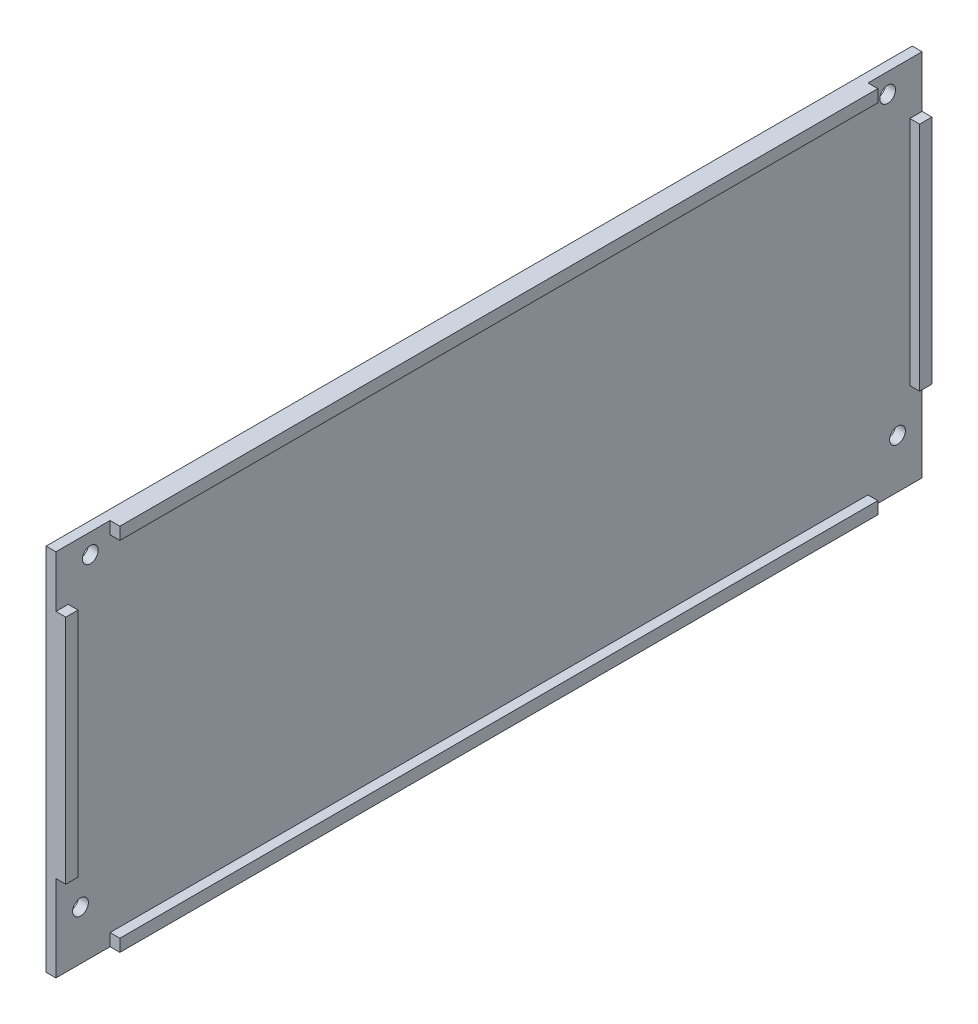
ISO-10303-21;
HEADER;
FILE_DESCRIPTION(('STEP AP214'),'2;1');
FILE_NAME('part.step','',(''),(''),'','','');
FILE_SCHEMA(('AUTOMOTIVE_DESIGN { 1 0 10303 214 1 1 1 1 }'));
ENDSEC;
DATA;
#1=APPLICATION_CONTEXT('core data for automotive mechanical design processes');
#2=APPLICATION_PROTOCOL_DEFINITION('international standard','automotive_design',2000,#1);
#3=PRODUCT_CONTEXT('',#1,'mechanical');
#4=PRODUCT('Part','Part','',(#3));
#5=PRODUCT_RELATED_PRODUCT_CATEGORY('part','',(#4));
#6=PRODUCT_DEFINITION_FORMATION('','',#4);
#7=PRODUCT_DEFINITION_CONTEXT('part definition',#1,'design');
#8=PRODUCT_DEFINITION('design','',#6,#7);
#9=PRODUCT_DEFINITION_SHAPE('','',#8);
#10=(LENGTH_UNIT() NAMED_UNIT(*) SI_UNIT(.MILLI.,.METRE.));
#11=(NAMED_UNIT(*) PLANE_ANGLE_UNIT() SI_UNIT($,.RADIAN.));
#12=(NAMED_UNIT(*) SI_UNIT($,.STERADIAN.) SOLID_ANGLE_UNIT());
#13=UNCERTAINTY_MEASURE_WITH_UNIT(LENGTH_MEASURE(1.E-05),#10,'distance_accuracy_value','');
#14=(GEOMETRIC_REPRESENTATION_CONTEXT(3) GLOBAL_UNCERTAINTY_ASSIGNED_CONTEXT((#13)) GLOBAL_UNIT_ASSIGNED_CONTEXT((#10,
#11,#12)) REPRESENTATION_CONTEXT('',''));
#15=CARTESIAN_POINT('',(0.,0.,0.));
#16=DIRECTION('',(0.,0.,1.));
#17=DIRECTION('',(1.,0.,0.));
#18=AXIS2_PLACEMENT_3D('',#15,#16,#17);
#19=CARTESIAN_POINT('',(2.,0.,0.));
#20=DIRECTION('',(1.,0.,0.));
#21=DIRECTION('',(0.,0.,-1.));
#22=AXIS2_PLACEMENT_3D('',#19,#20,#21);
#23=PLANE('',#22);
#24=CARTESIAN_POINT('',(2.,-27.5,83.));
#25=DIRECTION('',(1.,0.,0.));
#26=DIRECTION('',(0.,0.,-1.));
#27=AXIS2_PLACEMENT_3D('',#24,#25,#26);
#28=CIRCLE('',#27,1.6);
#29=CARTESIAN_POINT('',(2.,-27.5,81.4));
#30=VERTEX_POINT('',#29);
#31=EDGE_CURVE('E305',#30,#30,#28,.T.);
#32=ORIENTED_EDGE('',*,*,#31,.F.);
#33=EDGE_LOOP('',(#32));
#34=FACE_BOUND('',#33,.T.);
#35=CARTESIAN_POINT('',(2.,33.5,81.));
#36=DIRECTION('',(1.,0.,0.));
#37=DIRECTION('',(0.,0.,-1.));
#38=AXIS2_PLACEMENT_3D('',#35,#36,#37);
#39=CIRCLE('',#38,1.60000000000001);
#40=CARTESIAN_POINT('',(2.,33.5,79.4));
#41=VERTEX_POINT('',#40);
#42=EDGE_CURVE('E317',#41,#41,#39,.T.);
#43=ORIENTED_EDGE('',*,*,#42,.F.);
#44=EDGE_LOOP('',(#43));
#45=FACE_BOUND('',#44,.T.);
#46=CARTESIAN_POINT('',(2.,33.5,-81.));
#47=DIRECTION('',(1.,0.,0.));
#48=DIRECTION('',(0.,0.,1.));
#49=AXIS2_PLACEMENT_3D('',#46,#47,#48);
#50=CIRCLE('',#49,1.60000000000001);
#51=CARTESIAN_POINT('',(2.,33.5,-79.4));
#52=VERTEX_POINT('',#51);
#53=EDGE_CURVE('E311',#52,#52,#50,.T.);
#54=ORIENTED_EDGE('',*,*,#53,.F.);
#55=EDGE_LOOP('',(#54));
#56=FACE_BOUND('',#55,.T.);
#57=CARTESIAN_POINT('',(2.,-27.5,-82.9999999999999));
#58=DIRECTION('',(1.,0.,0.));
#59=DIRECTION('',(0.,0.,1.));
#60=AXIS2_PLACEMENT_3D('',#57,#58,#59);
#61=CIRCLE('',#60,1.6);
#62=CARTESIAN_POINT('',(2.,-27.5,-81.3999999999999));
#63=VERTEX_POINT('',#62);
#64=EDGE_CURVE('E299',#63,#63,#61,.T.);
#65=ORIENTED_EDGE('',*,*,#64,.F.);
#66=EDGE_LOOP('',(#65));
#67=FACE_BOUND('',#66,.T.);
#68=DIRECTION('',(0.,-1.,0.));
#69=VECTOR('',#68,1.);
#70=CARTESIAN_POINT('',(2.,27.,-85.5));
#71=LINE('',#70,#69);
#72=CARTESIAN_POINT('',(2.,27.,-85.5));
#73=VERTEX_POINT('',#72);
#74=CARTESIAN_POINT('',(2.,-20.,-85.5));
#75=VERTEX_POINT('',#74);
#76=EDGE_CURVE('E52',#73,#75,#71,.T.);
#77=ORIENTED_EDGE('',*,*,#76,.F.);
#78=DIRECTION('',(0.,0.,1.));
#79=VECTOR('',#78,1.);
#80=CARTESIAN_POINT('',(2.,27.,-88.));
#81=LINE('',#80,#79);
#82=CARTESIAN_POINT('',(2.,27.,-88.));
#83=VERTEX_POINT('',#82);
#84=EDGE_CURVE('E374',#83,#73,#81,.T.);
#85=ORIENTED_EDGE('',*,*,#84,.F.);
#86=DIRECTION('',(0.,1.,0.));
#87=VECTOR('',#86,1.);
#88=CARTESIAN_POINT('',(2.,37.5,-88.));
#89=LINE('',#88,#87);
#90=CARTESIAN_POINT('',(2.,37.5,-88.));
#91=VERTEX_POINT('',#90);
#92=EDGE_CURVE('E196',#83,#91,#89,.T.);
#93=ORIENTED_EDGE('',*,*,#92,.T.);
#94=DIRECTION('',(0.,0.,1.));
#95=VECTOR('',#94,1.);
#96=CARTESIAN_POINT('',(2.,37.5,88.));
#97=LINE('',#96,#95);
#98=CARTESIAN_POINT('',(2.,37.5,-77.));
#99=VERTEX_POINT('',#98);
#100=EDGE_CURVE('E326',#91,#99,#97,.T.);
#101=ORIENTED_EDGE('',*,*,#100,.T.);
#102=DIRECTION('',(0.,1.,0.));
#103=VECTOR('',#102,1.);
#104=CARTESIAN_POINT('',(2.,37.5,-77.));
#105=LINE('',#104,#103);
#106=CARTESIAN_POINT('',(2.,34.9999999999999,-77.));
#107=VERTEX_POINT('',#106);
#108=EDGE_CURVE('E240',#107,#99,#105,.T.);
#109=ORIENTED_EDGE('',*,*,#108,.F.);
#110=DIRECTION('',(0.,0.,-1.));
#111=VECTOR('',#110,1.);
#112=CARTESIAN_POINT('',(2.,35.,77.));
#113=LINE('',#112,#111);
#114=CARTESIAN_POINT('',(2.,35.,77.));
#115=VERTEX_POINT('',#114);
#116=EDGE_CURVE('E249',#115,#107,#113,.T.);
#117=ORIENTED_EDGE('',*,*,#116,.F.);
#118=DIRECTION('',(0.,-1.,0.));
#119=VECTOR('',#118,1.);
#120=CARTESIAN_POINT('',(2.,37.5,77.));
#121=LINE('',#120,#119);
#122=CARTESIAN_POINT('',(2.,37.5,77.));
#123=VERTEX_POINT('',#122);
#124=EDGE_CURVE('E235',#123,#115,#121,.T.);
#125=ORIENTED_EDGE('',*,*,#124,.F.);
#126=CARTESIAN_POINT('',(2.,37.5,88.));
#127=VERTEX_POINT('',#126);
#128=EDGE_CURVE('E325',#123,#127,#97,.T.);
#129=ORIENTED_EDGE('',*,*,#128,.T.);
#130=DIRECTION('',(0.,-1.,0.));
#131=VECTOR('',#130,1.);
#132=CARTESIAN_POINT('',(2.,37.5,88.));
#133=LINE('',#132,#131);
#134=CARTESIAN_POINT('',(2.,27.,88.));
#135=VERTEX_POINT('',#134);
#136=EDGE_CURVE('E329',#127,#135,#133,.T.);
#137=ORIENTED_EDGE('',*,*,#136,.T.);
#138=DIRECTION('',(0.,0.,1.));
#139=VECTOR('',#138,1.);
#140=CARTESIAN_POINT('',(2.,27.,88.));
#141=LINE('',#140,#139);
#142=CARTESIAN_POINT('',(2.,27.,85.5));
#143=VERTEX_POINT('',#142);
#144=EDGE_CURVE('E211',#143,#135,#141,.T.);
#145=ORIENTED_EDGE('',*,*,#144,.F.);
#146=DIRECTION('',(0.,1.,0.));
#147=VECTOR('',#146,1.);
#148=CARTESIAN_POINT('',(2.,27.,85.5));
#149=LINE('',#148,#147);
#150=CARTESIAN_POINT('',(2.,-20.,85.5));
#151=VERTEX_POINT('',#150);
#152=EDGE_CURVE('E200',#151,#143,#149,.T.);
#153=ORIENTED_EDGE('',*,*,#152,.F.);
#154=DIRECTION('',(0.,0.,-1.));
#155=VECTOR('',#154,1.);
#156=CARTESIAN_POINT('',(2.,-20.,88.));
#157=LINE('',#156,#155);
#158=CARTESIAN_POINT('',(2.,-20.,88.));
#159=VERTEX_POINT('',#158);
#160=EDGE_CURVE('E197',#159,#151,#157,.T.);
#161=ORIENTED_EDGE('',*,*,#160,.F.);
#162=CARTESIAN_POINT('',(2.,-37.5,88.));
#163=VERTEX_POINT('',#162);
#164=EDGE_CURVE('E328',#159,#163,#133,.T.);
#165=ORIENTED_EDGE('',*,*,#164,.T.);
#166=DIRECTION('',(0.,0.,-1.));
#167=VECTOR('',#166,1.);
#168=CARTESIAN_POINT('',(2.,-37.5,88.));
#169=LINE('',#168,#167);
#170=CARTESIAN_POINT('',(2.,-37.5,77.));
#171=VERTEX_POINT('',#170);
#172=EDGE_CURVE('E332',#163,#171,#169,.T.);
#173=ORIENTED_EDGE('',*,*,#172,.T.);
#174=DIRECTION('',(0.,-1.,0.));
#175=VECTOR('',#174,1.);
#176=CARTESIAN_POINT('',(2.,-37.5,77.));
#177=LINE('',#176,#175);
#178=CARTESIAN_POINT('',(2.,-35.,77.));
#179=VERTEX_POINT('',#178);
#180=EDGE_CURVE('E265',#179,#171,#177,.T.);
#181=ORIENTED_EDGE('',*,*,#180,.F.);
#182=DIRECTION('',(0.,0.,1.));
#183=VECTOR('',#182,1.);
#184=CARTESIAN_POINT('',(2.,-35.,77.));
#185=LINE('',#184,#183);
#186=CARTESIAN_POINT('',(2.,-34.9999999999999,-77.));
#187=VERTEX_POINT('',#186);
#188=EDGE_CURVE('E270',#187,#179,#185,.T.);
#189=ORIENTED_EDGE('',*,*,#188,.F.);
#190=DIRECTION('',(0.,1.,0.));
#191=VECTOR('',#190,1.);
#192=CARTESIAN_POINT('',(2.,-37.5,-77.));
#193=LINE('',#192,#191);
#194=CARTESIAN_POINT('',(2.,-37.5,-77.));
#195=VERTEX_POINT('',#194);
#196=EDGE_CURVE('E281',#195,#187,#193,.T.);
#197=ORIENTED_EDGE('',*,*,#196,.F.);
#198=CARTESIAN_POINT('',(2.,-37.5,-88.));
#199=VERTEX_POINT('',#198);
#200=EDGE_CURVE('E331',#195,#199,#169,.T.);
#201=ORIENTED_EDGE('',*,*,#200,.T.);
#202=CARTESIAN_POINT('',(2.,-20.,-88.));
#203=VERTEX_POINT('',#202);
#204=EDGE_CURVE('E323',#199,#203,#89,.T.);
#205=ORIENTED_EDGE('',*,*,#204,.T.);
#206=DIRECTION('',(0.,0.,-1.));
#207=VECTOR('',#206,1.);
#208=CARTESIAN_POINT('',(2.,-20.,-88.));
#209=LINE('',#208,#207);
#210=EDGE_CURVE('E57',#75,#203,#209,.T.);
#211=ORIENTED_EDGE('',*,*,#210,.F.);
#212=EDGE_LOOP('',(#77,#85,#93,#101,#109,#117,#125,#129,#137,#145,#153,#161,#165,#173,#181,#189,
#197,#201,#205,#211));
#213=FACE_BOUND('',#212,.T.);
#214=ADVANCED_FACE('F37',(#34,#45,#56,#67,#213),#23,.T.);
#215=CARTESIAN_POINT('',(0.,0.,0.));
#216=DIRECTION('',(1.,0.,0.));
#217=DIRECTION('',(0.,0.,-1.));
#218=AXIS2_PLACEMENT_3D('',#215,#216,#217);
#219=PLANE('',#218);
#220=DIRECTION('',(0.,1.,0.));
#221=VECTOR('',#220,1.);
#222=CARTESIAN_POINT('',(0.,37.5,-88.));
#223=LINE('',#222,#221);
#224=CARTESIAN_POINT('',(0.,-37.5,-88.));
#225=VERTEX_POINT('',#224);
#226=CARTESIAN_POINT('',(0.,37.5,-88.));
#227=VERTEX_POINT('',#226);
#228=EDGE_CURVE('E320',#225,#227,#223,.T.);
#229=ORIENTED_EDGE('',*,*,#228,.F.);
#230=DIRECTION('',(0.,0.,-1.));
#231=VECTOR('',#230,1.);
#232=CARTESIAN_POINT('',(0.,-37.5,88.));
#233=LINE('',#232,#231);
#234=CARTESIAN_POINT('',(0.,-37.5,88.));
#235=VERTEX_POINT('',#234);
#236=EDGE_CURVE('E342',#235,#225,#233,.T.);
#237=ORIENTED_EDGE('',*,*,#236,.F.);
#238=DIRECTION('',(0.,-1.,0.));
#239=VECTOR('',#238,1.);
#240=CARTESIAN_POINT('',(0.,37.5,88.));
#241=LINE('',#240,#239);
#242=CARTESIAN_POINT('',(0.,37.5,88.));
#243=VERTEX_POINT('',#242);
#244=EDGE_CURVE('E339',#243,#235,#241,.T.);
#245=ORIENTED_EDGE('',*,*,#244,.F.);
#246=DIRECTION('',(0.,0.,1.));
#247=VECTOR('',#246,1.);
#248=CARTESIAN_POINT('',(0.,37.5,88.));
#249=LINE('',#248,#247);
#250=EDGE_CURVE('E337',#227,#243,#249,.T.);
#251=ORIENTED_EDGE('',*,*,#250,.F.);
#252=EDGE_LOOP('',(#229,#237,#245,#251));
#253=FACE_BOUND('',#252,.T.);
#254=CARTESIAN_POINT('',(0.,33.5,81.));
#255=DIRECTION('',(1.,0.,0.));
#256=DIRECTION('',(0.,0.,-1.));
#257=AXIS2_PLACEMENT_3D('',#254,#255,#256);
#258=CIRCLE('',#257,1.60000000000001);
#259=CARTESIAN_POINT('',(0.,33.5,79.4));
#260=VERTEX_POINT('',#259);
#261=EDGE_CURVE('E314',#260,#260,#258,.T.);
#262=ORIENTED_EDGE('',*,*,#261,.T.);
#263=EDGE_LOOP('',(#262));
#264=FACE_BOUND('',#263,.T.);
#265=CARTESIAN_POINT('',(0.,33.5,-81.));
#266=DIRECTION('',(1.,0.,0.));
#267=DIRECTION('',(0.,0.,1.));
#268=AXIS2_PLACEMENT_3D('',#265,#266,#267);
#269=CIRCLE('',#268,1.60000000000001);
#270=CARTESIAN_POINT('',(0.,33.5,-79.4));
#271=VERTEX_POINT('',#270);
#272=EDGE_CURVE('E308',#271,#271,#269,.T.);
#273=ORIENTED_EDGE('',*,*,#272,.T.);
#274=EDGE_LOOP('',(#273));
#275=FACE_BOUND('',#274,.T.);
#276=CARTESIAN_POINT('',(0.,-27.5,83.));
#277=DIRECTION('',(1.,0.,0.));
#278=DIRECTION('',(0.,0.,-1.));
#279=AXIS2_PLACEMENT_3D('',#276,#277,#278);
#280=CIRCLE('',#279,1.6);
#281=CARTESIAN_POINT('',(0.,-27.5,81.4));
#282=VERTEX_POINT('',#281);
#283=EDGE_CURVE('E302',#282,#282,#280,.T.);
#284=ORIENTED_EDGE('',*,*,#283,.T.);
#285=EDGE_LOOP('',(#284));
#286=FACE_BOUND('',#285,.T.);
#287=CARTESIAN_POINT('',(0.,-27.5,-82.9999999999999));
#288=DIRECTION('',(1.,0.,0.));
#289=DIRECTION('',(0.,0.,1.));
#290=AXIS2_PLACEMENT_3D('',#287,#288,#289);
#291=CIRCLE('',#290,1.6);
#292=CARTESIAN_POINT('',(0.,-27.5,-81.3999999999999));
#293=VERTEX_POINT('',#292);
#294=EDGE_CURVE('E298',#293,#293,#291,.T.);
#295=ORIENTED_EDGE('',*,*,#294,.T.);
#296=EDGE_LOOP('',(#295));
#297=FACE_BOUND('',#296,.T.);
#298=ADVANCED_FACE('F360',(#253,#264,#275,#286,#297),#219,.F.);
#299=CARTESIAN_POINT('',(2.,37.5,-88.));
#300=DIRECTION('',(0.,0.,1.));
#301=DIRECTION('',(1.,0.,0.));
#302=AXIS2_PLACEMENT_3D('',#299,#300,#301);
#303=PLANE('',#302);
#304=ORIENTED_EDGE('',*,*,#228,.T.);
#305=DIRECTION('',(-1.,0.,0.));
#306=VECTOR('',#305,1.);
#307=CARTESIAN_POINT('',(2.,37.5,-88.));
#308=LINE('',#307,#306);
#309=EDGE_CURVE('E11',#91,#227,#308,.T.);
#310=ORIENTED_EDGE('',*,*,#309,.F.);
#311=ORIENTED_EDGE('',*,*,#92,.F.);
#312=DIRECTION('',(-1.,0.,0.));
#313=VECTOR('',#312,1.);
#314=CARTESIAN_POINT('',(4.,27.,-88.));
#315=LINE('',#314,#313);
#316=CARTESIAN_POINT('',(4.,27.,-88.));
#317=VERTEX_POINT('',#316);
#318=EDGE_CURVE('E177',#317,#83,#315,.T.);
#319=ORIENTED_EDGE('',*,*,#318,.F.);
#320=DIRECTION('',(0.,1.,0.));
#321=VECTOR('',#320,1.);
#322=CARTESIAN_POINT('',(4.,27.,-88.));
#323=LINE('',#322,#321);
#324=CARTESIAN_POINT('',(4.,-20.,-88.));
#325=VERTEX_POINT('',#324);
#326=EDGE_CURVE('E183',#325,#317,#323,.T.);
#327=ORIENTED_EDGE('',*,*,#326,.F.);
#328=DIRECTION('',(-1.,0.,0.));
#329=VECTOR('',#328,1.);
#330=CARTESIAN_POINT('',(4.,-20.,-88.));
#331=LINE('',#330,#329);
#332=EDGE_CURVE('E368',#325,#203,#331,.T.);
#333=ORIENTED_EDGE('',*,*,#332,.T.);
#334=ORIENTED_EDGE('',*,*,#204,.F.);
#335=DIRECTION('',(-1.,0.,0.));
#336=VECTOR('',#335,1.);
#337=CARTESIAN_POINT('',(2.,-37.5,-88.));
#338=LINE('',#337,#336);
#339=EDGE_CURVE('E334',#199,#225,#338,.T.);
#340=ORIENTED_EDGE('',*,*,#339,.T.);
#341=EDGE_LOOP('',(#304,#310,#311,#319,#327,#333,#334,#340));
#342=FACE_BOUND('',#341,.T.);
#343=ADVANCED_FACE('F39',(#342),#303,.F.);
#344=CARTESIAN_POINT('',(2.,37.5,88.));
#345=DIRECTION('',(0.,-1.,0.));
#346=DIRECTION('',(0.,0.,-1.));
#347=AXIS2_PLACEMENT_3D('',#344,#345,#346);
#348=PLANE('',#347);
#349=ORIENTED_EDGE('',*,*,#250,.T.);
#350=DIRECTION('',(-1.,0.,0.));
#351=VECTOR('',#350,1.);
#352=CARTESIAN_POINT('',(2.,37.5,88.));
#353=LINE('',#352,#351);
#354=EDGE_CURVE('E45',#127,#243,#353,.T.);
#355=ORIENTED_EDGE('',*,*,#354,.F.);
#356=ORIENTED_EDGE('',*,*,#128,.F.);
#357=DIRECTION('',(-1.,0.,0.));
#358=VECTOR('',#357,1.);
#359=CARTESIAN_POINT('',(4.,37.5,77.));
#360=LINE('',#359,#358);
#361=CARTESIAN_POINT('',(4.,37.5,77.));
#362=VERTEX_POINT('',#361);
#363=EDGE_CURVE('E246',#362,#123,#360,.T.);
#364=ORIENTED_EDGE('',*,*,#363,.F.);
#365=DIRECTION('',(0.,0.,1.));
#366=VECTOR('',#365,1.);
#367=CARTESIAN_POINT('',(4.,37.5,77.));
#368=LINE('',#367,#366);
#369=CARTESIAN_POINT('',(4.,37.5,-77.));
#370=VERTEX_POINT('',#369);
#371=EDGE_CURVE('E244',#370,#362,#368,.T.);
#372=ORIENTED_EDGE('',*,*,#371,.F.);
#373=DIRECTION('',(-1.,0.,0.));
#374=VECTOR('',#373,1.);
#375=CARTESIAN_POINT('',(4.,37.5,-77.));
#376=LINE('',#375,#374);
#377=EDGE_CURVE('E256',#370,#99,#376,.T.);
#378=ORIENTED_EDGE('',*,*,#377,.T.);
#379=ORIENTED_EDGE('',*,*,#100,.F.);
#380=ORIENTED_EDGE('',*,*,#309,.T.);
#381=EDGE_LOOP('',(#349,#355,#356,#364,#372,#378,#379,#380));
#382=FACE_BOUND('',#381,.T.);
#383=ADVANCED_FACE('F407',(#382),#348,.F.);
#384=CARTESIAN_POINT('',(2.,37.5,88.));
#385=DIRECTION('',(0.,0.,-1.));
#386=DIRECTION('',(0.,1.,0.));
#387=AXIS2_PLACEMENT_3D('',#384,#385,#386);
#388=PLANE('',#387);
#389=ORIENTED_EDGE('',*,*,#244,.T.);
#390=DIRECTION('',(-1.,0.,0.));
#391=VECTOR('',#390,1.);
#392=CARTESIAN_POINT('',(2.,-37.5,88.));
#393=LINE('',#392,#391);
#394=EDGE_CURVE('E347',#163,#235,#393,.T.);
#395=ORIENTED_EDGE('',*,*,#394,.F.);
#396=ORIENTED_EDGE('',*,*,#164,.F.);
#397=DIRECTION('',(-1.,0.,0.));
#398=VECTOR('',#397,1.);
#399=CARTESIAN_POINT('',(4.,-20.,88.));
#400=LINE('',#399,#398);
#401=CARTESIAN_POINT('',(4.,-20.,88.));
#402=VERTEX_POINT('',#401);
#403=EDGE_CURVE('E232',#402,#159,#400,.T.);
#404=ORIENTED_EDGE('',*,*,#403,.F.);
#405=DIRECTION('',(0.,-1.,0.));
#406=VECTOR('',#405,1.);
#407=CARTESIAN_POINT('',(4.,27.,88.));
#408=LINE('',#407,#406);
#409=CARTESIAN_POINT('',(4.,27.,88.));
#410=VERTEX_POINT('',#409);
#411=EDGE_CURVE('E206',#410,#402,#408,.T.);
#412=ORIENTED_EDGE('',*,*,#411,.F.);
#413=DIRECTION('',(-1.,0.,0.));
#414=VECTOR('',#413,1.);
#415=CARTESIAN_POINT('',(4.,27.,88.));
#416=LINE('',#415,#414);
#417=EDGE_CURVE('E217',#410,#135,#416,.T.);
#418=ORIENTED_EDGE('',*,*,#417,.T.);
#419=ORIENTED_EDGE('',*,*,#136,.F.);
#420=ORIENTED_EDGE('',*,*,#354,.T.);
#421=EDGE_LOOP('',(#389,#395,#396,#404,#412,#418,#419,#420));
#422=FACE_BOUND('',#421,.T.);
#423=ADVANCED_FACE('F354',(#422),#388,.F.);
#424=CARTESIAN_POINT('',(2.,-37.5,88.));
#425=DIRECTION('',(0.,1.,0.));
#426=DIRECTION('',(0.,0.,1.));
#427=AXIS2_PLACEMENT_3D('',#424,#425,#426);
#428=PLANE('',#427);
#429=ORIENTED_EDGE('',*,*,#236,.T.);
#430=ORIENTED_EDGE('',*,*,#339,.F.);
#431=ORIENTED_EDGE('',*,*,#200,.F.);
#432=DIRECTION('',(-1.,0.,0.));
#433=VECTOR('',#432,1.);
#434=CARTESIAN_POINT('',(4.,-37.5,-77.));
#435=LINE('',#434,#433);
#436=CARTESIAN_POINT('',(4.,-37.5,-77.));
#437=VERTEX_POINT('',#436);
#438=EDGE_CURVE('E292',#437,#195,#435,.T.);
#439=ORIENTED_EDGE('',*,*,#438,.F.);
#440=DIRECTION('',(0.,0.,-1.));
#441=VECTOR('',#440,1.);
#442=CARTESIAN_POINT('',(4.,-37.5,77.));
#443=LINE('',#442,#441);
#444=CARTESIAN_POINT('',(4.,-37.5,77.));
#445=VERTEX_POINT('',#444);
#446=EDGE_CURVE('E269',#445,#437,#443,.T.);
#447=ORIENTED_EDGE('',*,*,#446,.F.);
#448=DIRECTION('',(-1.,0.,0.));
#449=VECTOR('',#448,1.);
#450=CARTESIAN_POINT('',(4.,-37.5,77.));
#451=LINE('',#450,#449);
#452=EDGE_CURVE('E295',#445,#171,#451,.T.);
#453=ORIENTED_EDGE('',*,*,#452,.T.);
#454=ORIENTED_EDGE('',*,*,#172,.F.);
#455=ORIENTED_EDGE('',*,*,#394,.T.);
#456=EDGE_LOOP('',(#429,#430,#431,#439,#447,#453,#454,#455));
#457=FACE_BOUND('',#456,.T.);
#458=ADVANCED_FACE('F364',(#457),#428,.F.);
#459=CARTESIAN_POINT('',(2.,33.5,81.));
#460=DIRECTION('',(-1.,0.,0.));
#461=DIRECTION('',(0.,0.,1.));
#462=AXIS2_PLACEMENT_3D('',#459,#460,#461);
#463=CYLINDRICAL_SURFACE('',#462,1.60000000000001);
#464=ORIENTED_EDGE('',*,*,#42,.T.);
#465=EDGE_LOOP('',(#464));
#466=FACE_BOUND('',#465,.T.);
#467=ORIENTED_EDGE('',*,*,#261,.F.);
#468=EDGE_LOOP('',(#467));
#469=FACE_BOUND('',#468,.T.);
#470=ADVANCED_FACE('F401',(#466,#469),#463,.F.);
#471=CARTESIAN_POINT('',(2.,33.5,-81.));
#472=DIRECTION('',(-1.,0.,0.));
#473=DIRECTION('',(0.,0.,1.));
#474=AXIS2_PLACEMENT_3D('',#471,#472,#473);
#475=CYLINDRICAL_SURFACE('',#474,1.60000000000001);
#476=ORIENTED_EDGE('',*,*,#53,.T.);
#477=EDGE_LOOP('',(#476));
#478=FACE_BOUND('',#477,.T.);
#479=ORIENTED_EDGE('',*,*,#272,.F.);
#480=EDGE_LOOP('',(#479));
#481=FACE_BOUND('',#480,.T.);
#482=ADVANCED_FACE('F468',(#478,#481),#475,.F.);
#483=CARTESIAN_POINT('',(2.,-27.5,83.));
#484=DIRECTION('',(-1.,0.,0.));
#485=DIRECTION('',(0.,0.,1.));
#486=AXIS2_PLACEMENT_3D('',#483,#484,#485);
#487=CYLINDRICAL_SURFACE('',#486,1.6);
#488=ORIENTED_EDGE('',*,*,#31,.T.);
#489=EDGE_LOOP('',(#488));
#490=FACE_BOUND('',#489,.T.);
#491=ORIENTED_EDGE('',*,*,#283,.F.);
#492=EDGE_LOOP('',(#491));
#493=FACE_BOUND('',#492,.T.);
#494=ADVANCED_FACE('F465',(#490,#493),#487,.F.);
#495=CARTESIAN_POINT('',(2.,-27.5,-82.9999999999999));
#496=DIRECTION('',(-1.,0.,0.));
#497=DIRECTION('',(0.,0.,1.));
#498=AXIS2_PLACEMENT_3D('',#495,#496,#497);
#499=CYLINDRICAL_SURFACE('',#498,1.6);
#500=ORIENTED_EDGE('',*,*,#64,.T.);
#501=EDGE_LOOP('',(#500));
#502=FACE_BOUND('',#501,.T.);
#503=ORIENTED_EDGE('',*,*,#294,.F.);
#504=EDGE_LOOP('',(#503));
#505=FACE_BOUND('',#504,.T.);
#506=ADVANCED_FACE('F461',(#502,#505),#499,.F.);
#507=CARTESIAN_POINT('',(4.,-37.5,77.));
#508=DIRECTION('',(0.,0.,-1.));
#509=DIRECTION('',(-1.,0.,0.));
#510=AXIS2_PLACEMENT_3D('',#507,#508,#509);
#511=PLANE('',#510);
#512=ORIENTED_EDGE('',*,*,#180,.T.);
#513=ORIENTED_EDGE('',*,*,#452,.F.);
#514=DIRECTION('',(0.,-1.,0.));
#515=VECTOR('',#514,1.);
#516=CARTESIAN_POINT('',(4.,-37.5,77.));
#517=LINE('',#516,#515);
#518=CARTESIAN_POINT('',(4.,-35.,77.));
#519=VERTEX_POINT('',#518);
#520=EDGE_CURVE('E266',#519,#445,#517,.T.);
#521=ORIENTED_EDGE('',*,*,#520,.F.);
#522=DIRECTION('',(-1.,0.,0.));
#523=VECTOR('',#522,1.);
#524=CARTESIAN_POINT('',(4.,-35.,77.));
#525=LINE('',#524,#523);
#526=EDGE_CURVE('E278',#519,#179,#525,.T.);
#527=ORIENTED_EDGE('',*,*,#526,.T.);
#528=EDGE_LOOP('',(#512,#513,#521,#527));
#529=FACE_BOUND('',#528,.T.);
#530=ADVANCED_FACE('F457',(#529),#511,.F.);
#531=CARTESIAN_POINT('',(4.,-37.5,-77.));
#532=DIRECTION('',(0.,0.,1.));
#533=DIRECTION('',(1.,0.,0.));
#534=AXIS2_PLACEMENT_3D('',#531,#532,#533);
#535=PLANE('',#534);
#536=ORIENTED_EDGE('',*,*,#196,.T.);
#537=DIRECTION('',(-1.,0.,0.));
#538=VECTOR('',#537,1.);
#539=CARTESIAN_POINT('',(4.,-34.9999999999999,-77.));
#540=LINE('',#539,#538);
#541=CARTESIAN_POINT('',(4.,-34.9999999999999,-77.));
#542=VERTEX_POINT('',#541);
#543=EDGE_CURVE('E289',#542,#187,#540,.T.);
#544=ORIENTED_EDGE('',*,*,#543,.F.);
#545=DIRECTION('',(0.,1.,0.));
#546=VECTOR('',#545,1.);
#547=CARTESIAN_POINT('',(4.,-37.5,-77.));
#548=LINE('',#547,#546);
#549=EDGE_CURVE('E273',#437,#542,#548,.T.);
#550=ORIENTED_EDGE('',*,*,#549,.F.);
#551=ORIENTED_EDGE('',*,*,#438,.T.);
#552=EDGE_LOOP('',(#536,#544,#550,#551));
#553=FACE_BOUND('',#552,.T.);
#554=ADVANCED_FACE('F453',(#553),#535,.F.);
#555=CARTESIAN_POINT('',(4.,-35.,77.));
#556=DIRECTION('',(0.,-1.,0.));
#557=DIRECTION('',(0.,0.,-1.));
#558=AXIS2_PLACEMENT_3D('',#555,#556,#557);
#559=PLANE('',#558);
#560=ORIENTED_EDGE('',*,*,#188,.T.);
#561=ORIENTED_EDGE('',*,*,#526,.F.);
#562=DIRECTION('',(0.,0.,1.));
#563=VECTOR('',#562,1.);
#564=CARTESIAN_POINT('',(4.,-35.,77.));
#565=LINE('',#564,#563);
#566=EDGE_CURVE('E275',#542,#519,#565,.T.);
#567=ORIENTED_EDGE('',*,*,#566,.F.);
#568=ORIENTED_EDGE('',*,*,#543,.T.);
#569=EDGE_LOOP('',(#560,#561,#567,#568));
#570=FACE_BOUND('',#569,.T.);
#571=ADVANCED_FACE('F449',(#570),#559,.F.);
#572=CARTESIAN_POINT('',(4.,0.,0.));
#573=DIRECTION('',(-1.,0.,0.));
#574=DIRECTION('',(0.,0.,1.));
#575=AXIS2_PLACEMENT_3D('',#572,#573,#574);
#576=PLANE('',#575);
#577=ORIENTED_EDGE('',*,*,#520,.T.);
#578=ORIENTED_EDGE('',*,*,#446,.T.);
#579=ORIENTED_EDGE('',*,*,#549,.T.);
#580=ORIENTED_EDGE('',*,*,#566,.T.);
#581=EDGE_LOOP('',(#577,#578,#579,#580));
#582=FACE_BOUND('',#581,.T.);
#583=ADVANCED_FACE('F446',(#582),#576,.F.);
#584=CARTESIAN_POINT('',(4.,37.5,77.));
#585=DIRECTION('',(0.,0.,-1.));
#586=DIRECTION('',(-1.,0.,0.));
#587=AXIS2_PLACEMENT_3D('',#584,#585,#586);
#588=PLANE('',#587);
#589=ORIENTED_EDGE('',*,*,#124,.T.);
#590=DIRECTION('',(-1.,0.,0.));
#591=VECTOR('',#590,1.);
#592=CARTESIAN_POINT('',(4.,35.,77.));
#593=LINE('',#592,#591);
#594=CARTESIAN_POINT('',(4.,35.,77.));
#595=VERTEX_POINT('',#594);
#596=EDGE_CURVE('E262',#595,#115,#593,.T.);
#597=ORIENTED_EDGE('',*,*,#596,.F.);
#598=DIRECTION('',(0.,-1.,0.));
#599=VECTOR('',#598,1.);
#600=CARTESIAN_POINT('',(4.,37.5,77.));
#601=LINE('',#600,#599);
#602=EDGE_CURVE('E236',#362,#595,#601,.T.);
#603=ORIENTED_EDGE('',*,*,#602,.F.);
#604=ORIENTED_EDGE('',*,*,#363,.T.);
#605=EDGE_LOOP('',(#589,#597,#603,#604));
#606=FACE_BOUND('',#605,.T.);
#607=ADVANCED_FACE('F426',(#606),#588,.F.);
#608=CARTESIAN_POINT('',(4.,35.,77.));
#609=DIRECTION('',(0.,1.,0.));
#610=DIRECTION('',(0.,0.,1.));
#611=AXIS2_PLACEMENT_3D('',#608,#609,#610);
#612=PLANE('',#611);
#613=ORIENTED_EDGE('',*,*,#116,.T.);
#614=DIRECTION('',(-1.,0.,0.));
#615=VECTOR('',#614,1.);
#616=CARTESIAN_POINT('',(4.,34.9999999999999,-77.));
#617=LINE('',#616,#615);
#618=CARTESIAN_POINT('',(4.,34.9999999999999,-77.));
#619=VERTEX_POINT('',#618);
#620=EDGE_CURVE('E259',#619,#107,#617,.T.);
#621=ORIENTED_EDGE('',*,*,#620,.F.);
#622=DIRECTION('',(0.,0.,-1.));
#623=VECTOR('',#622,1.);
#624=CARTESIAN_POINT('',(4.,35.,77.));
#625=LINE('',#624,#623);
#626=EDGE_CURVE('E239',#595,#619,#625,.T.);
#627=ORIENTED_EDGE('',*,*,#626,.F.);
#628=ORIENTED_EDGE('',*,*,#596,.T.);
#629=EDGE_LOOP('',(#613,#621,#627,#628));
#630=FACE_BOUND('',#629,.T.);
#631=ADVANCED_FACE('F420',(#630),#612,.F.);
#632=CARTESIAN_POINT('',(4.,37.5,-77.));
#633=DIRECTION('',(0.,0.,1.));
#634=DIRECTION('',(1.,0.,0.));
#635=AXIS2_PLACEMENT_3D('',#632,#633,#634);
#636=PLANE('',#635);
#637=ORIENTED_EDGE('',*,*,#108,.T.);
#638=ORIENTED_EDGE('',*,*,#377,.F.);
#639=DIRECTION('',(0.,1.,0.));
#640=VECTOR('',#639,1.);
#641=CARTESIAN_POINT('',(4.,37.5,-77.));
#642=LINE('',#641,#640);
#643=EDGE_CURVE('E242',#619,#370,#642,.T.);
#644=ORIENTED_EDGE('',*,*,#643,.F.);
#645=ORIENTED_EDGE('',*,*,#620,.T.);
#646=EDGE_LOOP('',(#637,#638,#644,#645));
#647=FACE_BOUND('',#646,.T.);
#648=ADVANCED_FACE('F416',(#647),#636,.F.);
#649=CARTESIAN_POINT('',(4.,0.,0.));
#650=DIRECTION('',(1.,0.,0.));
#651=DIRECTION('',(0.,0.,-1.));
#652=AXIS2_PLACEMENT_3D('',#649,#650,#651);
#653=PLANE('',#652);
#654=ORIENTED_EDGE('',*,*,#602,.T.);
#655=ORIENTED_EDGE('',*,*,#626,.T.);
#656=ORIENTED_EDGE('',*,*,#643,.T.);
#657=ORIENTED_EDGE('',*,*,#371,.T.);
#658=EDGE_LOOP('',(#654,#655,#656,#657));
#659=FACE_BOUND('',#658,.T.);
#660=ADVANCED_FACE('F428',(#659),#653,.T.);
#661=CARTESIAN_POINT('',(4.,-20.,88.));
#662=DIRECTION('',(0.,1.,0.));
#663=DIRECTION('',(0.,0.,1.));
#664=AXIS2_PLACEMENT_3D('',#661,#662,#663);
#665=PLANE('',#664);
#666=ORIENTED_EDGE('',*,*,#160,.T.);
#667=DIRECTION('',(-1.,0.,0.));
#668=VECTOR('',#667,1.);
#669=CARTESIAN_POINT('',(4.,-20.,85.5));
#670=LINE('',#669,#668);
#671=CARTESIAN_POINT('',(4.,-20.,85.5));
#672=VERTEX_POINT('',#671);
#673=EDGE_CURVE('E229',#672,#151,#670,.T.);
#674=ORIENTED_EDGE('',*,*,#673,.F.);
#675=DIRECTION('',(0.,0.,-1.));
#676=VECTOR('',#675,1.);
#677=CARTESIAN_POINT('',(4.,-20.,88.));
#678=LINE('',#677,#676);
#679=EDGE_CURVE('E210',#402,#672,#678,.T.);
#680=ORIENTED_EDGE('',*,*,#679,.F.);
#681=ORIENTED_EDGE('',*,*,#403,.T.);
#682=EDGE_LOOP('',(#666,#674,#680,#681));
#683=FACE_BOUND('',#682,.T.);
#684=ADVANCED_FACE('F430',(#683),#665,.F.);
#685=CARTESIAN_POINT('',(4.,27.,85.5));
#686=DIRECTION('',(0.,0.,1.));
#687=DIRECTION('',(1.,0.,0.));
#688=AXIS2_PLACEMENT_3D('',#685,#686,#687);
#689=PLANE('',#688);
#690=ORIENTED_EDGE('',*,*,#152,.T.);
#691=DIRECTION('',(-1.,0.,0.));
#692=VECTOR('',#691,1.);
#693=CARTESIAN_POINT('',(4.,27.,85.5));
#694=LINE('',#693,#692);
#695=CARTESIAN_POINT('',(4.,27.,85.5));
#696=VERTEX_POINT('',#695);
#697=EDGE_CURVE('E226',#696,#143,#694,.T.);
#698=ORIENTED_EDGE('',*,*,#697,.F.);
#699=DIRECTION('',(0.,1.,0.));
#700=VECTOR('',#699,1.);
#701=CARTESIAN_POINT('',(4.,27.,85.5));
#702=LINE('',#701,#700);
#703=EDGE_CURVE('E213',#672,#696,#702,.T.);
#704=ORIENTED_EDGE('',*,*,#703,.F.);
#705=ORIENTED_EDGE('',*,*,#673,.T.);
#706=EDGE_LOOP('',(#690,#698,#704,#705));
#707=FACE_BOUND('',#706,.T.);
#708=ADVANCED_FACE('F436',(#707),#689,.F.);
#709=CARTESIAN_POINT('',(4.,27.,88.));
#710=DIRECTION('',(0.,-1.,0.));
#711=DIRECTION('',(0.,0.,-1.));
#712=AXIS2_PLACEMENT_3D('',#709,#710,#711);
#713=PLANE('',#712);
#714=ORIENTED_EDGE('',*,*,#144,.T.);
#715=ORIENTED_EDGE('',*,*,#417,.F.);
#716=DIRECTION('',(0.,0.,1.));
#717=VECTOR('',#716,1.);
#718=CARTESIAN_POINT('',(4.,27.,88.));
#719=LINE('',#718,#717);
#720=EDGE_CURVE('E216',#696,#410,#719,.T.);
#721=ORIENTED_EDGE('',*,*,#720,.F.);
#722=ORIENTED_EDGE('',*,*,#697,.T.);
#723=EDGE_LOOP('',(#714,#715,#721,#722));
#724=FACE_BOUND('',#723,.T.);
#725=ADVANCED_FACE('F525',(#724),#713,.F.);
#726=CARTESIAN_POINT('',(4.,0.,0.));
#727=DIRECTION('',(1.,0.,0.));
#728=DIRECTION('',(0.,0.,-1.));
#729=AXIS2_PLACEMENT_3D('',#726,#727,#728);
#730=PLANE('',#729);
#731=ORIENTED_EDGE('',*,*,#411,.T.);
#732=ORIENTED_EDGE('',*,*,#679,.T.);
#733=ORIENTED_EDGE('',*,*,#703,.T.);
#734=ORIENTED_EDGE('',*,*,#720,.T.);
#735=EDGE_LOOP('',(#731,#732,#733,#734));
#736=FACE_BOUND('',#735,.T.);
#737=ADVANCED_FACE('F389',(#736),#730,.T.);
#738=CARTESIAN_POINT('',(4.,27.,-88.));
#739=DIRECTION('',(0.,-1.,0.));
#740=DIRECTION('',(0.,0.,-1.));
#741=AXIS2_PLACEMENT_3D('',#738,#739,#740);
#742=PLANE('',#741);
#743=ORIENTED_EDGE('',*,*,#84,.T.);
#744=DIRECTION('',(-1.,0.,0.));
#745=VECTOR('',#744,1.);
#746=CARTESIAN_POINT('',(4.,27.,-85.5));
#747=LINE('',#746,#745);
#748=CARTESIAN_POINT('',(4.,27.,-85.5));
#749=VERTEX_POINT('',#748);
#750=EDGE_CURVE('E179',#749,#73,#747,.T.);
#751=ORIENTED_EDGE('',*,*,#750,.F.);
#752=DIRECTION('',(0.,0.,1.));
#753=VECTOR('',#752,1.);
#754=CARTESIAN_POINT('',(4.,27.,-88.));
#755=LINE('',#754,#753);
#756=EDGE_CURVE('E173',#317,#749,#755,.T.);
#757=ORIENTED_EDGE('',*,*,#756,.F.);
#758=ORIENTED_EDGE('',*,*,#318,.T.);
#759=EDGE_LOOP('',(#743,#751,#757,#758));
#760=FACE_BOUND('',#759,.T.);
#761=ADVANCED_FACE('F175',(#760),#742,.F.);
#762=CARTESIAN_POINT('',(4.,27.,-85.5));
#763=DIRECTION('',(0.,0.,-1.));
#764=DIRECTION('',(-1.,0.,0.));
#765=AXIS2_PLACEMENT_3D('',#762,#763,#764);
#766=PLANE('',#765);
#767=ORIENTED_EDGE('',*,*,#76,.T.);
#768=DIRECTION('',(-1.,0.,0.));
#769=VECTOR('',#768,1.);
#770=CARTESIAN_POINT('',(4.,-20.,-85.5));
#771=LINE('',#770,#769);
#772=CARTESIAN_POINT('',(4.,-20.,-85.5));
#773=VERTEX_POINT('',#772);
#774=EDGE_CURVE('E202',#773,#75,#771,.T.);
#775=ORIENTED_EDGE('',*,*,#774,.F.);
#776=DIRECTION('',(0.,-1.,0.));
#777=VECTOR('',#776,1.);
#778=CARTESIAN_POINT('',(4.,27.,-85.5));
#779=LINE('',#778,#777);
#780=EDGE_CURVE('E182',#749,#773,#779,.T.);
#781=ORIENTED_EDGE('',*,*,#780,.F.);
#782=ORIENTED_EDGE('',*,*,#750,.T.);
#783=EDGE_LOOP('',(#767,#775,#781,#782));
#784=FACE_BOUND('',#783,.T.);
#785=ADVANCED_FACE('F381',(#784),#766,.F.);
#786=CARTESIAN_POINT('',(4.,-20.,-88.));
#787=DIRECTION('',(0.,1.,0.));
#788=DIRECTION('',(0.,0.,1.));
#789=AXIS2_PLACEMENT_3D('',#786,#787,#788);
#790=PLANE('',#789);
#791=ORIENTED_EDGE('',*,*,#210,.T.);
#792=ORIENTED_EDGE('',*,*,#332,.F.);
#793=DIRECTION('',(0.,0.,-1.));
#794=VECTOR('',#793,1.);
#795=CARTESIAN_POINT('',(4.,-20.,-88.));
#796=LINE('',#795,#794);
#797=EDGE_CURVE('E188',#773,#325,#796,.T.);
#798=ORIENTED_EDGE('',*,*,#797,.F.);
#799=ORIENTED_EDGE('',*,*,#774,.T.);
#800=EDGE_LOOP('',(#791,#792,#798,#799));
#801=FACE_BOUND('',#800,.T.);
#802=ADVANCED_FACE('F371',(#801),#790,.F.);
#803=CARTESIAN_POINT('',(4.,0.,0.));
#804=DIRECTION('',(-1.,0.,0.));
#805=DIRECTION('',(0.,0.,1.));
#806=AXIS2_PLACEMENT_3D('',#803,#804,#805);
#807=PLANE('',#806);
#808=ORIENTED_EDGE('',*,*,#326,.T.);
#809=ORIENTED_EDGE('',*,*,#756,.T.);
#810=ORIENTED_EDGE('',*,*,#780,.T.);
#811=ORIENTED_EDGE('',*,*,#797,.T.);
#812=EDGE_LOOP('',(#808,#809,#810,#811));
#813=FACE_BOUND('',#812,.T.);
#814=ADVANCED_FACE('F186',(#813),#807,.F.);
#815=CLOSED_SHELL('',(#214,#298,#343,#383,#423,#458,#470,#482,#494,#506,#530,#554,#571,#583,
#607,#631,#648,#660,#684,#708,#725,#737,#761,#785,#802,#814));
#816=MANIFOLD_SOLID_BREP('B2',#815);
#817=ADVANCED_BREP_SHAPE_REPRESENTATION('',(#18,#816),#14);
#818=SHAPE_DEFINITION_REPRESENTATION(#9,#817);
ENDSEC;
END-ISO-10303-21;
